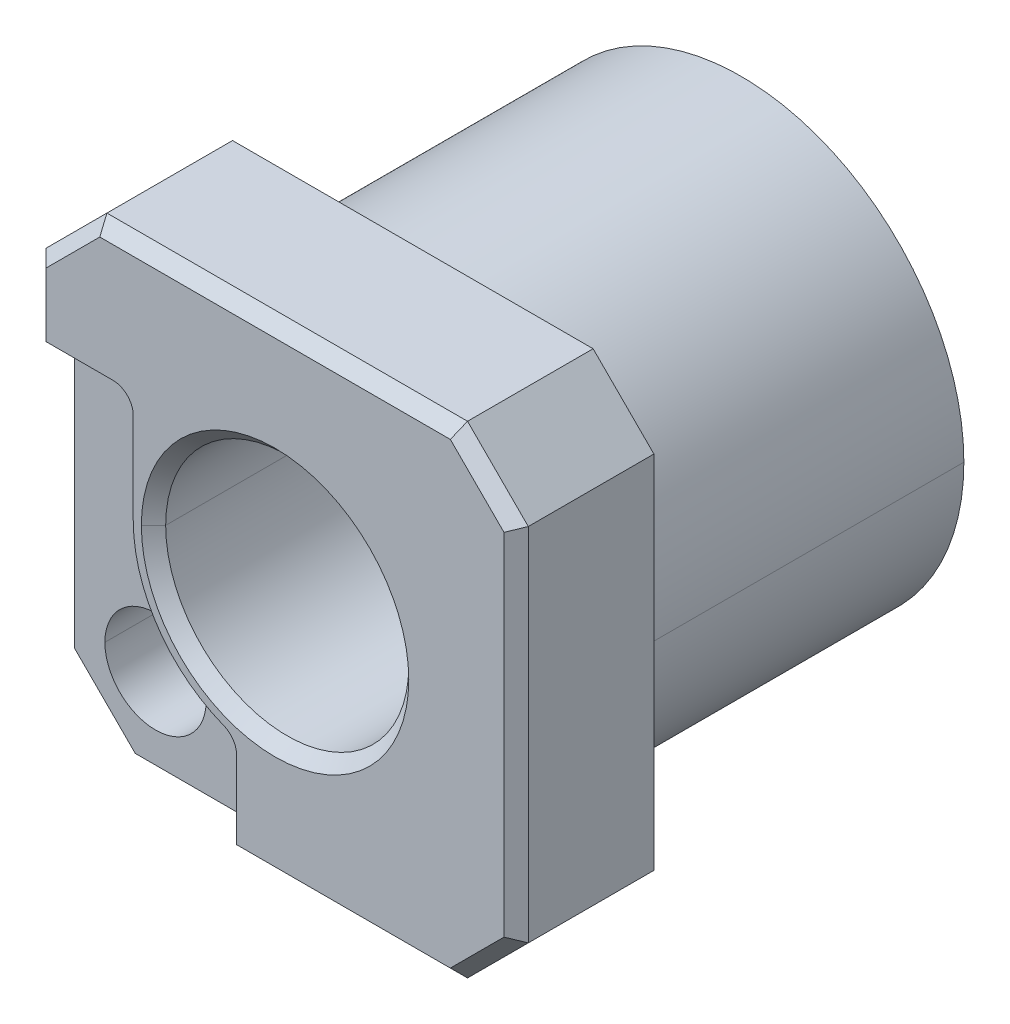
ISO-10303-21;
HEADER;
FILE_DESCRIPTION(('STEP AP214'),'2;1');
FILE_NAME('part.step','',(''),(''),'','','');
FILE_SCHEMA(('AUTOMOTIVE_DESIGN { 1 0 10303 214 1 1 1 1 }'));
ENDSEC;
DATA;
#1=APPLICATION_CONTEXT('core data for automotive mechanical design processes');
#2=APPLICATION_PROTOCOL_DEFINITION('international standard','automotive_design',2000,#1);
#3=PRODUCT_CONTEXT('',#1,'mechanical');
#4=PRODUCT('Part','Part','',(#3));
#5=PRODUCT_RELATED_PRODUCT_CATEGORY('part','',(#4));
#6=PRODUCT_DEFINITION_FORMATION('','',#4);
#7=PRODUCT_DEFINITION_CONTEXT('part definition',#1,'design');
#8=PRODUCT_DEFINITION('design','',#6,#7);
#9=PRODUCT_DEFINITION_SHAPE('','',#8);
#10=(LENGTH_UNIT() NAMED_UNIT(*) SI_UNIT(.MILLI.,.METRE.));
#11=(NAMED_UNIT(*) PLANE_ANGLE_UNIT() SI_UNIT($,.RADIAN.));
#12=(NAMED_UNIT(*) SI_UNIT($,.STERADIAN.) SOLID_ANGLE_UNIT());
#13=UNCERTAINTY_MEASURE_WITH_UNIT(LENGTH_MEASURE(1.E-05),#10,'distance_accuracy_value','');
#14=(GEOMETRIC_REPRESENTATION_CONTEXT(3) GLOBAL_UNCERTAINTY_ASSIGNED_CONTEXT((#13)) GLOBAL_UNIT_ASSIGNED_CONTEXT((#10,
#11,#12)) REPRESENTATION_CONTEXT('',''));
#15=CARTESIAN_POINT('',(0.,0.,0.));
#16=DIRECTION('',(0.,0.,1.));
#17=DIRECTION('',(1.,0.,0.));
#18=AXIS2_PLACEMENT_3D('',#15,#16,#17);
#19=CARTESIAN_POINT('',(0.,0.,0.));
#20=DIRECTION('',(0.,0.,1.));
#21=DIRECTION('',(1.,0.,0.));
#22=AXIS2_PLACEMENT_3D('',#19,#20,#21);
#23=CYLINDRICAL_SURFACE('',#22,5.5);
#24=DIRECTION('',(0.,0.,1.));
#25=VECTOR('',#24,1.);
#26=CARTESIAN_POINT('',(-5.5,0.,0.));
#27=LINE('',#26,#25);
#28=CARTESIAN_POINT('',(-5.5,0.,-8.1));
#29=VERTEX_POINT('',#28);
#30=CARTESIAN_POINT('',(-5.5,0.,0.));
#31=VERTEX_POINT('',#30);
#32=EDGE_CURVE('E361',#29,#31,#27,.T.);
#33=ORIENTED_EDGE('',*,*,#32,.F.);
#34=CARTESIAN_POINT('',(0.,0.,-8.1));
#35=DIRECTION('',(0.,0.,1.));
#36=DIRECTION('',(1.,0.,0.));
#37=AXIS2_PLACEMENT_3D('',#34,#35,#36);
#38=CIRCLE('',#37,5.5);
#39=CARTESIAN_POINT('',(5.5,0.,-8.1));
#40=VERTEX_POINT('',#39);
#41=EDGE_CURVE('E285',#29,#40,#38,.T.);
#42=ORIENTED_EDGE('',*,*,#41,.T.);
#43=DIRECTION('',(0.,0.,1.));
#44=VECTOR('',#43,1.);
#45=CARTESIAN_POINT('',(5.5,0.,0.));
#46=LINE('',#45,#44);
#47=CARTESIAN_POINT('',(5.5,0.,0.));
#48=VERTEX_POINT('',#47);
#49=EDGE_CURVE('E360',#40,#48,#46,.T.);
#50=ORIENTED_EDGE('',*,*,#49,.T.);
#51=CARTESIAN_POINT('',(0.,0.,0.));
#52=DIRECTION('',(0.,0.,-1.));
#53=DIRECTION('',(1.,0.,0.));
#54=AXIS2_PLACEMENT_3D('',#51,#52,#53);
#55=CIRCLE('',#54,5.5);
#56=CARTESIAN_POINT('',(-2.921261188788,-4.660067925136,0.));
#57=VERTEX_POINT('',#56);
#58=EDGE_CURVE('E403',#48,#57,#55,.T.);
#59=ORIENTED_EDGE('',*,*,#58,.T.);
#60=CARTESIAN_POINT('',(0.,0.,0.));
#61=DIRECTION('',(0.,0.,-1.));
#62=DIRECTION('',(1.,0.,0.));
#63=AXIS2_PLACEMENT_3D('',#60,#61,#62);
#64=CIRCLE('',#63,5.5);
#65=CARTESIAN_POINT('',(-4.660067925136,-2.921261188788,0.));
#66=VERTEX_POINT('',#65);
#67=EDGE_CURVE('E28',#57,#66,#64,.T.);
#68=ORIENTED_EDGE('',*,*,#67,.T.);
#69=CARTESIAN_POINT('',(0.,0.,0.));
#70=DIRECTION('',(0.,0.,-1.));
#71=DIRECTION('',(1.,0.,0.));
#72=AXIS2_PLACEMENT_3D('',#69,#70,#71);
#73=CIRCLE('',#72,5.5);
#74=EDGE_CURVE('E378',#66,#31,#73,.T.);
#75=ORIENTED_EDGE('',*,*,#74,.T.);
#76=EDGE_LOOP('',(#33,#42,#50,#59,#68,#75));
#77=FACE_BOUND('',#76,.T.);
#78=ADVANCED_FACE('F17',(#77),#23,.T.);
#79=CARTESIAN_POINT('',(-3.95,-3.95,2.4));
#80=DIRECTION('',(0.,0.,1.));
#81=DIRECTION('',(1.,0.,0.));
#82=AXIS2_PLACEMENT_3D('',#79,#80,#81);
#83=CYLINDRICAL_SURFACE('',#82,1.25);
#84=DIRECTION('',(0.,0.,1.));
#85=VECTOR('',#84,1.);
#86=CARTESIAN_POINT('',(-5.2,-3.95,2.4));
#87=LINE('',#86,#85);
#88=CARTESIAN_POINT('',(-5.2,-3.95,0.));
#89=VERTEX_POINT('',#88);
#90=CARTESIAN_POINT('',(-5.2,-3.95,2.4));
#91=VERTEX_POINT('',#90);
#92=EDGE_CURVE('E435',#89,#91,#87,.T.);
#93=ORIENTED_EDGE('',*,*,#92,.F.);
#94=CARTESIAN_POINT('',(-3.95,-3.95,0.));
#95=DIRECTION('',(0.,0.,1.));
#96=DIRECTION('',(1.,0.,0.));
#97=AXIS2_PLACEMENT_3D('',#94,#95,#96);
#98=CIRCLE('',#97,1.25);
#99=EDGE_CURVE('E381',#66,#89,#98,.T.);
#100=ORIENTED_EDGE('',*,*,#99,.F.);
#101=CARTESIAN_POINT('',(-3.95,-3.95,0.));
#102=DIRECTION('',(0.,0.,1.));
#103=DIRECTION('',(1.,0.,0.));
#104=AXIS2_PLACEMENT_3D('',#101,#102,#103);
#105=CIRCLE('',#104,1.25);
#106=CARTESIAN_POINT('',(-2.7,-3.95,0.));
#107=VERTEX_POINT('',#106);
#108=EDGE_CURVE('E284',#107,#66,#105,.T.);
#109=ORIENTED_EDGE('',*,*,#108,.F.);
#110=DIRECTION('',(0.,0.,1.));
#111=VECTOR('',#110,1.);
#112=CARTESIAN_POINT('',(-2.7,-3.95,2.4));
#113=LINE('',#112,#111);
#114=CARTESIAN_POINT('',(-2.7,-3.95,2.4));
#115=VERTEX_POINT('',#114);
#116=EDGE_CURVE('E412',#107,#115,#113,.T.);
#117=ORIENTED_EDGE('',*,*,#116,.T.);
#118=CARTESIAN_POINT('',(-3.95,-3.95,2.4));
#119=DIRECTION('',(0.,0.,1.));
#120=DIRECTION('',(1.,0.,0.));
#121=AXIS2_PLACEMENT_3D('',#118,#119,#120);
#122=CIRCLE('',#121,1.25);
#123=EDGE_CURVE('E400',#115,#91,#122,.T.);
#124=ORIENTED_EDGE('',*,*,#123,.T.);
#125=EDGE_LOOP('',(#93,#100,#109,#117,#124));
#126=FACE_BOUND('',#125,.T.);
#127=ADVANCED_FACE('F683',(#126),#83,.F.);
#128=CARTESIAN_POINT('',(0.,0.,3.1));
#129=DIRECTION('',(0.,0.,1.));
#130=DIRECTION('',(1.,0.,0.));
#131=AXIS2_PLACEMENT_3D('',#128,#129,#130);
#132=CONICAL_SURFACE('',#131,3.,0.785398163397001);
#133=DIRECTION('',(-0.707106781186231,0.,0.707106781186864));
#134=VECTOR('',#133,1.);
#135=CARTESIAN_POINT('',(-3.,0.,3.1));
#136=LINE('',#135,#134);
#137=CARTESIAN_POINT('',(-3.,0.,3.1));
#138=VERTEX_POINT('',#137);
#139=CARTESIAN_POINT('',(-3.29999999999973,0.,3.4));
#140=VERTEX_POINT('',#139);
#141=EDGE_CURVE('E390',#138,#140,#136,.T.);
#142=ORIENTED_EDGE('',*,*,#141,.F.);
#143=CARTESIAN_POINT('',(0.,0.,3.1));
#144=DIRECTION('',(0.,0.,1.));
#145=DIRECTION('',(1.,0.,0.));
#146=AXIS2_PLACEMENT_3D('',#143,#144,#145);
#147=CIRCLE('',#146,3.);
#148=CARTESIAN_POINT('',(3.,0.,3.1));
#149=VERTEX_POINT('',#148);
#150=EDGE_CURVE('E11',#149,#138,#147,.T.);
#151=ORIENTED_EDGE('',*,*,#150,.F.);
#152=DIRECTION('',(0.707106781186231,0.,0.707106781186864));
#153=VECTOR('',#152,1.);
#154=CARTESIAN_POINT('',(3.,0.,3.1));
#155=LINE('',#154,#153);
#156=CARTESIAN_POINT('',(3.29999999999973,0.,3.4));
#157=VERTEX_POINT('',#156);
#158=EDGE_CURVE('E297',#149,#157,#155,.T.);
#159=ORIENTED_EDGE('',*,*,#158,.T.);
#160=CARTESIAN_POINT('',(0.,0.,3.4));
#161=DIRECTION('',(0.,0.,1.));
#162=DIRECTION('',(1.,0.,0.));
#163=AXIS2_PLACEMENT_3D('',#160,#161,#162);
#164=CIRCLE('',#163,3.3);
#165=EDGE_CURVE('E258',#157,#140,#164,.T.);
#166=ORIENTED_EDGE('',*,*,#165,.T.);
#167=EDGE_LOOP('',(#142,#151,#159,#166));
#168=FACE_BOUND('',#167,.T.);
#169=ADVANCED_FACE('F681',(#168),#132,.F.);
#170=CARTESIAN_POINT('',(0.,0.,0.));
#171=DIRECTION('',(0.,0.,1.));
#172=DIRECTION('',(1.,0.,0.));
#173=AXIS2_PLACEMENT_3D('',#170,#171,#172);
#174=CYLINDRICAL_SURFACE('',#173,3.);
#175=DIRECTION('',(0.,0.,1.));
#176=VECTOR('',#175,1.);
#177=CARTESIAN_POINT('',(-3.,0.,0.));
#178=LINE('',#177,#176);
#179=CARTESIAN_POINT('',(-3.,0.,-8.1));
#180=VERTEX_POINT('',#179);
#181=EDGE_CURVE('E288',#180,#138,#178,.T.);
#182=ORIENTED_EDGE('',*,*,#181,.F.);
#183=CARTESIAN_POINT('',(0.,0.,-8.1));
#184=DIRECTION('',(0.,0.,1.));
#185=DIRECTION('',(1.,0.,0.));
#186=AXIS2_PLACEMENT_3D('',#183,#184,#185);
#187=CIRCLE('',#186,3.);
#188=CARTESIAN_POINT('',(3.,0.,-8.1));
#189=VERTEX_POINT('',#188);
#190=EDGE_CURVE('E275',#189,#180,#187,.T.);
#191=ORIENTED_EDGE('',*,*,#190,.F.);
#192=DIRECTION('',(0.,0.,1.));
#193=VECTOR('',#192,1.);
#194=CARTESIAN_POINT('',(3.,0.,0.));
#195=LINE('',#194,#193);
#196=EDGE_CURVE('E293',#189,#149,#195,.T.);
#197=ORIENTED_EDGE('',*,*,#196,.T.);
#198=ORIENTED_EDGE('',*,*,#150,.T.);
#199=EDGE_LOOP('',(#182,#191,#197,#198));
#200=FACE_BOUND('',#199,.T.);
#201=ADVANCED_FACE('F289',(#200),#174,.F.);
#202=CARTESIAN_POINT('',(0.,0.,0.));
#203=DIRECTION('',(0.,0.,1.));
#204=DIRECTION('',(1.,0.,0.));
#205=AXIS2_PLACEMENT_3D('',#202,#203,#204);
#206=PLANE('',#205);
#207=CARTESIAN_POINT('',(-3.95,-3.95,0.));
#208=DIRECTION('',(0.,0.,1.));
#209=DIRECTION('',(1.,0.,0.));
#210=AXIS2_PLACEMENT_3D('',#207,#208,#209);
#211=CIRCLE('',#210,1.25);
#212=EDGE_CURVE('E391',#57,#107,#211,.T.);
#213=ORIENTED_EDGE('',*,*,#212,.T.);
#214=ORIENTED_EDGE('',*,*,#108,.T.);
#215=ORIENTED_EDGE('',*,*,#67,.F.);
#216=EDGE_LOOP('',(#213,#214,#215));
#217=FACE_BOUND('',#216,.T.);
#218=ADVANCED_FACE('F690',(#217),#206,.T.);
#219=CARTESIAN_POINT('',(0.,0.,-8.1));
#220=DIRECTION('',(0.,0.,1.));
#221=DIRECTION('',(1.,0.,0.));
#222=AXIS2_PLACEMENT_3D('',#219,#220,#221);
#223=PLANE('',#222);
#224=ORIENTED_EDGE('',*,*,#190,.T.);
#225=CARTESIAN_POINT('',(0.,0.,-8.1));
#226=DIRECTION('',(0.,0.,1.));
#227=DIRECTION('',(1.,0.,0.));
#228=AXIS2_PLACEMENT_3D('',#225,#226,#227);
#229=CIRCLE('',#228,3.);
#230=EDGE_CURVE('E280',#180,#189,#229,.T.);
#231=ORIENTED_EDGE('',*,*,#230,.T.);
#232=EDGE_LOOP('',(#224,#231));
#233=FACE_BOUND('',#232,.T.);
#234=CARTESIAN_POINT('',(0.,0.,-8.1));
#235=DIRECTION('',(0.,0.,1.));
#236=DIRECTION('',(1.,0.,0.));
#237=AXIS2_PLACEMENT_3D('',#234,#235,#236);
#238=CIRCLE('',#237,5.5);
#239=EDGE_CURVE('E554',#40,#29,#238,.T.);
#240=ORIENTED_EDGE('',*,*,#239,.F.);
#241=ORIENTED_EDGE('',*,*,#41,.F.);
#242=EDGE_LOOP('',(#240,#241));
#243=FACE_BOUND('',#242,.T.);
#244=ADVANCED_FACE('F277',(#233,#243),#223,.F.);
#245=CARTESIAN_POINT('',(4.45,-5.8,3.25));
#246=DIRECTION('',(0.,-0.707106781186548,0.707106781186548));
#247=DIRECTION('',(-1.,0.,0.));
#248=AXIS2_PLACEMENT_3D('',#245,#246,#247);
#249=PLANE('',#248);
#250=DIRECTION('',(0.281084637714927,-0.678598344545825,-0.678598344545825));
#251=VECTOR('',#250,1.);
#252=CARTESIAN_POINT('',(4.308975681847,-5.609537178492,3.440462821508));
#253=LINE('',#252,#251);
#254=CARTESIAN_POINT('',(4.325735931288,-5.65,3.4));
#255=VERTEX_POINT('',#254);
#256=CARTESIAN_POINT('',(4.45,-5.95,3.1));
#257=VERTEX_POINT('',#256);
#258=EDGE_CURVE('E451',#255,#257,#253,.T.);
#259=ORIENTED_EDGE('',*,*,#258,.F.);
#260=DIRECTION('',(-1.,0.,0.));
#261=VECTOR('',#260,1.);
#262=CARTESIAN_POINT('',(4.45,-5.65,3.4));
#263=LINE('',#262,#261);
#264=CARTESIAN_POINT('',(-0.95,-5.65,3.4));
#265=VERTEX_POINT('',#264);
#266=EDGE_CURVE('E320',#255,#265,#263,.T.);
#267=ORIENTED_EDGE('',*,*,#266,.T.);
#268=DIRECTION('',(0.,-0.707106781186548,-0.707106781186548));
#269=VECTOR('',#268,1.);
#270=CARTESIAN_POINT('',(-0.95,-5.244483771318,3.805516228682));
#271=LINE('',#270,#269);
#272=CARTESIAN_POINT('',(-0.95,-5.95,3.1));
#273=VERTEX_POINT('',#272);
#274=EDGE_CURVE('E328',#265,#273,#271,.T.);
#275=ORIENTED_EDGE('',*,*,#274,.T.);
#276=DIRECTION('',(-1.,0.,0.));
#277=VECTOR('',#276,1.);
#278=CARTESIAN_POINT('',(4.45,-5.95,3.1));
#279=LINE('',#278,#277);
#280=EDGE_CURVE('E459',#257,#273,#279,.T.);
#281=ORIENTED_EDGE('',*,*,#280,.F.);
#282=EDGE_LOOP('',(#259,#267,#275,#281));
#283=FACE_BOUND('',#282,.T.);
#284=ADVANCED_FACE('F608',(#283),#249,.T.);
#285=CARTESIAN_POINT('',(5.843933982822,-4.343933982822,3.25));
#286=DIRECTION('',(0.49999999999984,-0.49999999999984,0.707106781186774));
#287=DIRECTION('',(-0.707106781186548,-0.707106781186548,0.));
#288=AXIS2_PLACEMENT_3D('',#285,#286,#287);
#289=PLANE('',#288);
#290=DIRECTION('',(0.678598344545825,-0.281084637714927,-0.678598344545825));
#291=VECTOR('',#290,1.);
#292=CARTESIAN_POINT('',(4.963042400288,-4.041188776712,4.086957599712));
#293=LINE('',#292,#291);
#294=CARTESIAN_POINT('',(5.65,-4.325735931288,3.4));
#295=VERTEX_POINT('',#294);
#296=CARTESIAN_POINT('',(5.95,-4.45,3.1));
#297=VERTEX_POINT('',#296);
#298=EDGE_CURVE('E239',#295,#297,#293,.T.);
#299=ORIENTED_EDGE('',*,*,#298,.F.);
#300=DIRECTION('',(-0.707106781186548,-0.707106781186548,0.));
#301=VECTOR('',#300,1.);
#302=CARTESIAN_POINT('',(5.737867965644,-4.237867965644,3.4));
#303=LINE('',#302,#301);
#304=EDGE_CURVE('E324',#295,#255,#303,.T.);
#305=ORIENTED_EDGE('',*,*,#304,.T.);
#306=ORIENTED_EDGE('',*,*,#258,.T.);
#307=DIRECTION('',(-0.707106781186548,-0.707106781186548,0.));
#308=VECTOR('',#307,1.);
#309=CARTESIAN_POINT('',(5.95,-4.45,3.1));
#310=LINE('',#309,#308);
#311=EDGE_CURVE('E411',#297,#257,#310,.T.);
#312=ORIENTED_EDGE('',*,*,#311,.F.);
#313=EDGE_LOOP('',(#299,#305,#306,#312));
#314=FACE_BOUND('',#313,.T.);
#315=ADVANCED_FACE('F604',(#314),#289,.T.);
#316=CARTESIAN_POINT('',(-0.95,-3.727935085272,3.4));
#317=DIRECTION('',(-1.,0.,0.));
#318=DIRECTION('',(0.,0.,1.));
#319=AXIS2_PLACEMENT_3D('',#316,#317,#318);
#320=PLANE('',#319);
#321=DIRECTION('',(0.,0.,-1.));
#322=VECTOR('',#321,1.);
#323=CARTESIAN_POINT('',(-0.95,-5.95,3.4));
#324=LINE('',#323,#322);
#325=CARTESIAN_POINT('',(-0.95,-5.95,2.4));
#326=VERTEX_POINT('',#325);
#327=EDGE_CURVE('E463',#273,#326,#324,.T.);
#328=ORIENTED_EDGE('',*,*,#327,.F.);
#329=ORIENTED_EDGE('',*,*,#274,.F.);
#330=DIRECTION('',(0.,-1.,0.));
#331=VECTOR('',#330,1.);
#332=CARTESIAN_POINT('',(-0.95,-3.727935085272,3.4));
#333=LINE('',#332,#331);
#334=CARTESIAN_POINT('',(-0.95,-3.727935085272,3.4));
#335=VERTEX_POINT('',#334);
#336=EDGE_CURVE('E325',#335,#265,#333,.T.);
#337=ORIENTED_EDGE('',*,*,#336,.F.);
#338=DIRECTION('',(0.,0.,-1.));
#339=VECTOR('',#338,1.);
#340=CARTESIAN_POINT('',(-0.95,-3.727935085272,3.4));
#341=LINE('',#340,#339);
#342=CARTESIAN_POINT('',(-0.95,-3.727935085272,2.4));
#343=VERTEX_POINT('',#342);
#344=EDGE_CURVE('E329',#335,#343,#341,.T.);
#345=ORIENTED_EDGE('',*,*,#344,.T.);
#346=DIRECTION('',(0.,-1.,0.));
#347=VECTOR('',#346,1.);
#348=CARTESIAN_POINT('',(-0.95,-3.727935085272,2.4));
#349=LINE('',#348,#347);
#350=EDGE_CURVE('E386',#343,#326,#349,.T.);
#351=ORIENTED_EDGE('',*,*,#350,.T.);
#352=EDGE_LOOP('',(#328,#329,#337,#345,#351));
#353=FACE_BOUND('',#352,.T.);
#354=ADVANCED_FACE('F614',(#353),#320,.T.);
#355=CARTESIAN_POINT('',(5.8,4.45,3.25));
#356=DIRECTION('',(0.707106781186548,0.,0.707106781186548));
#357=DIRECTION('',(0.,-1.,0.));
#358=AXIS2_PLACEMENT_3D('',#355,#356,#357);
#359=PLANE('',#358);
#360=DIRECTION('',(-0.678598344545825,-0.281084637714927,0.678598344545825));
#361=VECTOR('',#360,1.);
#362=CARTESIAN_POINT('',(5.609537178492,4.308975681847,3.440462821508));
#363=LINE('',#362,#361);
#364=CARTESIAN_POINT('',(5.95,4.45,3.1));
#365=VERTEX_POINT('',#364);
#366=CARTESIAN_POINT('',(5.65,4.325735931288,3.4));
#367=VERTEX_POINT('',#366);
#368=EDGE_CURVE('E247',#365,#367,#363,.T.);
#369=ORIENTED_EDGE('',*,*,#368,.T.);
#370=DIRECTION('',(0.,-1.,0.));
#371=VECTOR('',#370,1.);
#372=CARTESIAN_POINT('',(5.65,4.45,3.4));
#373=LINE('',#372,#371);
#374=EDGE_CURVE('E495',#367,#295,#373,.T.);
#375=ORIENTED_EDGE('',*,*,#374,.T.);
#376=ORIENTED_EDGE('',*,*,#298,.T.);
#377=DIRECTION('',(0.,-1.,0.));
#378=VECTOR('',#377,1.);
#379=CARTESIAN_POINT('',(5.95,4.45,3.1));
#380=LINE('',#379,#378);
#381=EDGE_CURVE('E367',#365,#297,#380,.T.);
#382=ORIENTED_EDGE('',*,*,#381,.F.);
#383=EDGE_LOOP('',(#369,#375,#376,#382));
#384=FACE_BOUND('',#383,.T.);
#385=ADVANCED_FACE('F744',(#384),#359,.T.);
#386=CARTESIAN_POINT('',(-1.45,-3.727935085272,3.4));
#387=DIRECTION('',(0.,0.,1.));
#388=DIRECTION('',(1.,0.,0.));
#389=AXIS2_PLACEMENT_3D('',#386,#387,#388);
#390=CYLINDRICAL_SURFACE('',#389,0.5);
#391=CARTESIAN_POINT('',(-1.45,-3.727935085272,3.4));
#392=DIRECTION('',(0.,0.,1.));
#393=DIRECTION('',(1.,0.,0.));
#394=AXIS2_PLACEMENT_3D('',#391,#392,#393);
#395=CIRCLE('',#394,0.5);
#396=CARTESIAN_POINT('',(-1.26875,-3.261943199613,3.4));
#397=VERTEX_POINT('',#396);
#398=EDGE_CURVE('E319',#335,#397,#395,.T.);
#399=ORIENTED_EDGE('',*,*,#398,.T.);
#400=DIRECTION('',(0.,0.,-1.));
#401=VECTOR('',#400,1.);
#402=CARTESIAN_POINT('',(-1.26875,-3.261943199613,3.4));
#403=LINE('',#402,#401);
#404=CARTESIAN_POINT('',(-1.26875,-3.261943199613,2.4));
#405=VERTEX_POINT('',#404);
#406=EDGE_CURVE('E450',#397,#405,#403,.T.);
#407=ORIENTED_EDGE('',*,*,#406,.T.);
#408=CARTESIAN_POINT('',(-1.45,-3.727935085272,2.4));
#409=DIRECTION('',(0.,0.,1.));
#410=DIRECTION('',(1.,0.,0.));
#411=AXIS2_PLACEMENT_3D('',#408,#409,#410);
#412=CIRCLE('',#411,0.5);
#413=EDGE_CURVE('E373',#343,#405,#412,.T.);
#414=ORIENTED_EDGE('',*,*,#413,.F.);
#415=ORIENTED_EDGE('',*,*,#344,.F.);
#416=EDGE_LOOP('',(#399,#407,#414,#415));
#417=FACE_BOUND('',#416,.T.);
#418=ADVANCED_FACE('F732',(#417),#390,.F.);
#419=CARTESIAN_POINT('',(0.,0.,3.4));
#420=DIRECTION('',(0.,0.,1.));
#421=DIRECTION('',(1.,0.,0.));
#422=AXIS2_PLACEMENT_3D('',#419,#420,#421);
#423=CYLINDRICAL_SURFACE('',#422,3.5);
#424=DIRECTION('',(0.,0.,-1.));
#425=VECTOR('',#424,1.);
#426=CARTESIAN_POINT('',(-3.5,0.,3.4));
#427=LINE('',#426,#425);
#428=CARTESIAN_POINT('',(-3.5,0.,3.4));
#429=VERTEX_POINT('',#428);
#430=CARTESIAN_POINT('',(-3.5,0.,2.4));
#431=VERTEX_POINT('',#430);
#432=EDGE_CURVE('E399',#429,#431,#427,.T.);
#433=ORIENTED_EDGE('',*,*,#432,.T.);
#434=CARTESIAN_POINT('',(0.,0.,2.4));
#435=DIRECTION('',(0.,0.,1.));
#436=DIRECTION('',(1.,0.,0.));
#437=AXIS2_PLACEMENT_3D('',#434,#435,#436);
#438=CIRCLE('',#437,3.5);
#439=EDGE_CURVE('E368',#431,#405,#438,.T.);
#440=ORIENTED_EDGE('',*,*,#439,.T.);
#441=ORIENTED_EDGE('',*,*,#406,.F.);
#442=CARTESIAN_POINT('',(0.,0.,3.4));
#443=DIRECTION('',(0.,0.,1.));
#444=DIRECTION('',(1.,0.,0.));
#445=AXIS2_PLACEMENT_3D('',#442,#443,#444);
#446=CIRCLE('',#445,3.5);
#447=EDGE_CURVE('E315',#429,#397,#446,.T.);
#448=ORIENTED_EDGE('',*,*,#447,.F.);
#449=EDGE_LOOP('',(#433,#440,#441,#448));
#450=FACE_BOUND('',#449,.T.);
#451=ADVANCED_FACE('F729',(#450),#423,.T.);
#452=CARTESIAN_POINT('',(-3.5,2.25,3.4));
#453=DIRECTION('',(-1.,0.,0.));
#454=DIRECTION('',(0.,0.,1.));
#455=AXIS2_PLACEMENT_3D('',#452,#453,#454);
#456=PLANE('',#455);
#457=DIRECTION('',(0.,0.,-1.));
#458=VECTOR('',#457,1.);
#459=CARTESIAN_POINT('',(-3.5,2.25,3.4));
#460=LINE('',#459,#458);
#461=CARTESIAN_POINT('',(-3.5,2.25,3.4));
#462=VERTEX_POINT('',#461);
#463=CARTESIAN_POINT('',(-3.5,2.25,2.4));
#464=VERTEX_POINT('',#463);
#465=EDGE_CURVE('E43',#462,#464,#460,.T.);
#466=ORIENTED_EDGE('',*,*,#465,.T.);
#467=DIRECTION('',(0.,-1.,0.));
#468=VECTOR('',#467,1.);
#469=CARTESIAN_POINT('',(-3.5,2.25,2.4));
#470=LINE('',#469,#468);
#471=EDGE_CURVE('E372',#464,#431,#470,.T.);
#472=ORIENTED_EDGE('',*,*,#471,.T.);
#473=ORIENTED_EDGE('',*,*,#432,.F.);
#474=DIRECTION('',(0.,-1.,0.));
#475=VECTOR('',#474,1.);
#476=CARTESIAN_POINT('',(-3.5,2.25,3.4));
#477=LINE('',#476,#475);
#478=EDGE_CURVE('E21',#462,#429,#477,.T.);
#479=ORIENTED_EDGE('',*,*,#478,.F.);
#480=EDGE_LOOP('',(#466,#472,#473,#479));
#481=FACE_BOUND('',#480,.T.);
#482=ADVANCED_FACE('F19',(#481),#456,.T.);
#483=CARTESIAN_POINT('',(-4.,2.25,3.4));
#484=DIRECTION('',(0.,0.,1.));
#485=DIRECTION('',(1.,0.,0.));
#486=AXIS2_PLACEMENT_3D('',#483,#484,#485);
#487=CYLINDRICAL_SURFACE('',#486,0.5);
#488=CARTESIAN_POINT('',(-4.,2.25,3.4));
#489=DIRECTION('',(0.,0.,1.));
#490=DIRECTION('',(1.,0.,0.));
#491=AXIS2_PLACEMENT_3D('',#488,#489,#490);
#492=CIRCLE('',#491,0.5);
#493=CARTESIAN_POINT('',(-4.,2.75,3.4));
#494=VERTEX_POINT('',#493);
#495=EDGE_CURVE('E347',#462,#494,#492,.T.);
#496=ORIENTED_EDGE('',*,*,#495,.T.);
#497=DIRECTION('',(0.,0.,-1.));
#498=VECTOR('',#497,1.);
#499=CARTESIAN_POINT('',(-4.,2.75,3.4));
#500=LINE('',#499,#498);
#501=CARTESIAN_POINT('',(-4.,2.75,2.4));
#502=VERTEX_POINT('',#501);
#503=EDGE_CURVE('E392',#494,#502,#500,.T.);
#504=ORIENTED_EDGE('',*,*,#503,.T.);
#505=CARTESIAN_POINT('',(-4.,2.25,2.4));
#506=DIRECTION('',(0.,0.,1.));
#507=DIRECTION('',(1.,0.,0.));
#508=AXIS2_PLACEMENT_3D('',#505,#506,#507);
#509=CIRCLE('',#508,0.5);
#510=EDGE_CURVE('E404',#464,#502,#509,.T.);
#511=ORIENTED_EDGE('',*,*,#510,.F.);
#512=ORIENTED_EDGE('',*,*,#465,.F.);
#513=EDGE_LOOP('',(#496,#504,#511,#512));
#514=FACE_BOUND('',#513,.T.);
#515=ADVANCED_FACE('F577',(#514),#487,.F.);
#516=CARTESIAN_POINT('',(-4.028350418133,-2.114058066306,2.4));
#517=DIRECTION('',(0.,0.,1.));
#518=DIRECTION('',(1.,0.,0.));
#519=AXIS2_PLACEMENT_3D('',#516,#517,#518);
#520=PLANE('',#519);
#521=ORIENTED_EDGE('',*,*,#123,.F.);
#522=CARTESIAN_POINT('',(-3.95,-3.95,2.4));
#523=DIRECTION('',(0.,0.,1.));
#524=DIRECTION('',(1.,0.,0.));
#525=AXIS2_PLACEMENT_3D('',#522,#523,#524);
#526=CIRCLE('',#525,1.25);
#527=EDGE_CURVE('E416',#91,#115,#526,.T.);
#528=ORIENTED_EDGE('',*,*,#527,.F.);
#529=EDGE_LOOP('',(#521,#528));
#530=FACE_BOUND('',#529,.T.);
#531=DIRECTION('',(-1.,0.,0.));
#532=VECTOR('',#531,1.);
#533=CARTESIAN_POINT('',(-0.95,-5.95,2.4));
#534=LINE('',#533,#532);
#535=CARTESIAN_POINT('',(-4.45,-5.95,2.4));
#536=VERTEX_POINT('',#535);
#537=EDGE_CURVE('E420',#326,#536,#534,.T.);
#538=ORIENTED_EDGE('',*,*,#537,.F.);
#539=ORIENTED_EDGE('',*,*,#350,.F.);
#540=ORIENTED_EDGE('',*,*,#413,.T.);
#541=ORIENTED_EDGE('',*,*,#439,.F.);
#542=ORIENTED_EDGE('',*,*,#471,.F.);
#543=ORIENTED_EDGE('',*,*,#510,.T.);
#544=DIRECTION('',(1.,0.,0.));
#545=VECTOR('',#544,1.);
#546=CARTESIAN_POINT('',(-5.95,2.75,2.4));
#547=LINE('',#546,#545);
#548=CARTESIAN_POINT('',(-5.95,2.75,2.4));
#549=VERTEX_POINT('',#548);
#550=EDGE_CURVE('E396',#549,#502,#547,.T.);
#551=ORIENTED_EDGE('',*,*,#550,.F.);
#552=DIRECTION('',(0.,1.,0.));
#553=VECTOR('',#552,1.);
#554=CARTESIAN_POINT('',(-5.95,-5.95,2.4));
#555=LINE('',#554,#553);
#556=CARTESIAN_POINT('',(-5.95,-4.45,2.4));
#557=VERTEX_POINT('',#556);
#558=EDGE_CURVE('E334',#557,#549,#555,.T.);
#559=ORIENTED_EDGE('',*,*,#558,.F.);
#560=DIRECTION('',(0.707106781186548,-0.707106781186548,0.));
#561=VECTOR('',#560,1.);
#562=CARTESIAN_POINT('',(-5.678573087957,-4.721426912043,2.4));
#563=LINE('',#562,#561);
#564=EDGE_CURVE('E377',#557,#536,#563,.T.);
#565=ORIENTED_EDGE('',*,*,#564,.T.);
#566=EDGE_LOOP('',(#538,#539,#540,#541,#542,#543,#551,#559,#565));
#567=FACE_BOUND('',#566,.T.);
#568=ADVANCED_FACE('F573',(#530,#567),#520,.T.);
#569=CARTESIAN_POINT('',(-5.95,2.75,3.4));
#570=DIRECTION('',(0.,-1.,0.));
#571=DIRECTION('',(0.,0.,-1.));
#572=AXIS2_PLACEMENT_3D('',#569,#570,#571);
#573=PLANE('',#572);
#574=DIRECTION('',(0.,0.,-1.));
#575=VECTOR('',#574,1.);
#576=CARTESIAN_POINT('',(-5.95,2.75,3.4));
#577=LINE('',#576,#575);
#578=CARTESIAN_POINT('',(-5.95,2.75,3.1));
#579=VERTEX_POINT('',#578);
#580=EDGE_CURVE('E427',#579,#549,#577,.T.);
#581=ORIENTED_EDGE('',*,*,#580,.T.);
#582=ORIENTED_EDGE('',*,*,#550,.T.);
#583=ORIENTED_EDGE('',*,*,#503,.F.);
#584=DIRECTION('',(1.,0.,0.));
#585=VECTOR('',#584,1.);
#586=CARTESIAN_POINT('',(-5.95,2.75,3.4));
#587=LINE('',#586,#585);
#588=CARTESIAN_POINT('',(-5.65,2.75,3.4));
#589=VERTEX_POINT('',#588);
#590=EDGE_CURVE('E351',#589,#494,#587,.T.);
#591=ORIENTED_EDGE('',*,*,#590,.F.);
#592=DIRECTION('',(-0.707106781186548,0.,-0.707106781186548));
#593=VECTOR('',#592,1.);
#594=CARTESIAN_POINT('',(-5.8,2.75,3.25));
#595=LINE('',#594,#593);
#596=EDGE_CURVE('E417',#589,#579,#595,.T.);
#597=ORIENTED_EDGE('',*,*,#596,.T.);
#598=EDGE_LOOP('',(#581,#582,#583,#591,#597));
#599=FACE_BOUND('',#598,.T.);
#600=ADVANCED_FACE('F567',(#599),#573,.T.);
#601=CARTESIAN_POINT('',(-5.8,2.75,3.25));
#602=DIRECTION('',(-0.707106781186548,0.,0.707106781186548));
#603=DIRECTION('',(0.,1.,0.));
#604=AXIS2_PLACEMENT_3D('',#601,#602,#603);
#605=PLANE('',#604);
#606=ORIENTED_EDGE('',*,*,#596,.F.);
#607=DIRECTION('',(0.,1.,0.));
#608=VECTOR('',#607,1.);
#609=CARTESIAN_POINT('',(-5.65,2.75,3.4));
#610=LINE('',#609,#608);
#611=CARTESIAN_POINT('',(-5.65,4.325735931288,3.4));
#612=VERTEX_POINT('',#611);
#613=EDGE_CURVE('E471',#589,#612,#610,.T.);
#614=ORIENTED_EDGE('',*,*,#613,.T.);
#615=DIRECTION('',(-0.678598344545825,0.281084637714927,-0.678598344545825));
#616=VECTOR('',#615,1.);
#617=CARTESIAN_POINT('',(-5.447405144136,4.241818394322,3.602594855864));
#618=LINE('',#617,#616);
#619=CARTESIAN_POINT('',(-5.95,4.45,3.1));
#620=VERTEX_POINT('',#619);
#621=EDGE_CURVE('E458',#612,#620,#618,.T.);
#622=ORIENTED_EDGE('',*,*,#621,.T.);
#623=DIRECTION('',(0.,1.,0.));
#624=VECTOR('',#623,1.);
#625=CARTESIAN_POINT('',(-5.95,2.75,3.1));
#626=LINE('',#625,#624);
#627=EDGE_CURVE('E423',#579,#620,#626,.T.);
#628=ORIENTED_EDGE('',*,*,#627,.F.);
#629=EDGE_LOOP('',(#606,#614,#622,#628));
#630=FACE_BOUND('',#629,.T.);
#631=ADVANCED_FACE('F751',(#630),#605,.T.);
#632=CARTESIAN_POINT('',(5.95,-5.95,0.));
#633=DIRECTION('',(0.,-1.,0.));
#634=DIRECTION('',(0.,0.,-1.));
#635=AXIS2_PLACEMENT_3D('',#632,#633,#634);
#636=PLANE('',#635);
#637=DIRECTION('',(0.,0.,1.));
#638=VECTOR('',#637,1.);
#639=CARTESIAN_POINT('',(4.45,-5.95,0.));
#640=LINE('',#639,#638);
#641=CARTESIAN_POINT('',(4.45,-5.95,0.));
#642=VERTEX_POINT('',#641);
#643=EDGE_CURVE('E464',#642,#257,#640,.T.);
#644=ORIENTED_EDGE('',*,*,#643,.T.);
#645=ORIENTED_EDGE('',*,*,#280,.T.);
#646=ORIENTED_EDGE('',*,*,#327,.T.);
#647=ORIENTED_EDGE('',*,*,#537,.T.);
#648=DIRECTION('',(0.,0.,1.));
#649=VECTOR('',#648,1.);
#650=CARTESIAN_POINT('',(-4.45,-5.95,0.));
#651=LINE('',#650,#649);
#652=CARTESIAN_POINT('',(-4.45,-5.95,0.));
#653=VERTEX_POINT('',#652);
#654=EDGE_CURVE('E366',#653,#536,#651,.T.);
#655=ORIENTED_EDGE('',*,*,#654,.F.);
#656=DIRECTION('',(-1.,0.,0.));
#657=VECTOR('',#656,1.);
#658=CARTESIAN_POINT('',(5.95,-5.95,0.));
#659=LINE('',#658,#657);
#660=EDGE_CURVE('E310',#642,#653,#659,.T.);
#661=ORIENTED_EDGE('',*,*,#660,.F.);
#662=EDGE_LOOP('',(#644,#645,#646,#647,#655,#661));
#663=FACE_BOUND('',#662,.T.);
#664=ADVANCED_FACE('F597',(#663),#636,.T.);
#665=CARTESIAN_POINT('',(5.2,-5.2,0.));
#666=DIRECTION('',(0.707106781186548,-0.707106781186548,0.));
#667=DIRECTION('',(0.,0.,-1.));
#668=AXIS2_PLACEMENT_3D('',#665,#666,#667);
#669=PLANE('',#668);
#670=DIRECTION('',(0.,0.,1.));
#671=VECTOR('',#670,1.);
#672=CARTESIAN_POINT('',(5.95,-4.45,0.));
#673=LINE('',#672,#671);
#674=CARTESIAN_POINT('',(5.95,-4.45,0.));
#675=VERTEX_POINT('',#674);
#676=EDGE_CURVE('E362',#675,#297,#673,.T.);
#677=ORIENTED_EDGE('',*,*,#676,.T.);
#678=ORIENTED_EDGE('',*,*,#311,.T.);
#679=ORIENTED_EDGE('',*,*,#643,.F.);
#680=DIRECTION('',(-0.707106781186548,-0.707106781186548,0.));
#681=VECTOR('',#680,1.);
#682=CARTESIAN_POINT('',(5.2,-5.2,0.));
#683=LINE('',#682,#681);
#684=EDGE_CURVE('E314',#675,#642,#683,.T.);
#685=ORIENTED_EDGE('',*,*,#684,.F.);
#686=EDGE_LOOP('',(#677,#678,#679,#685));
#687=FACE_BOUND('',#686,.T.);
#688=ADVANCED_FACE('F602',(#687),#669,.T.);
#689=CARTESIAN_POINT('',(-5.2,-5.2,0.));
#690=DIRECTION('',(-0.707106781186548,-0.707106781186548,0.));
#691=DIRECTION('',(-0.707106781186548,0.707106781186548,0.));
#692=AXIS2_PLACEMENT_3D('',#689,#690,#691);
#693=PLANE('',#692);
#694=ORIENTED_EDGE('',*,*,#654,.T.);
#695=ORIENTED_EDGE('',*,*,#564,.F.);
#696=DIRECTION('',(0.,0.,1.));
#697=VECTOR('',#696,1.);
#698=CARTESIAN_POINT('',(-5.95,-4.45,0.));
#699=LINE('',#698,#697);
#700=CARTESIAN_POINT('',(-5.95,-4.45,0.));
#701=VERTEX_POINT('',#700);
#702=EDGE_CURVE('E330',#701,#557,#699,.T.);
#703=ORIENTED_EDGE('',*,*,#702,.F.);
#704=DIRECTION('',(0.707106781186548,-0.707106781186548,0.));
#705=VECTOR('',#704,1.);
#706=CARTESIAN_POINT('',(-5.2,-5.2,0.));
#707=LINE('',#706,#705);
#708=EDGE_CURVE('E313',#701,#653,#707,.T.);
#709=ORIENTED_EDGE('',*,*,#708,.T.);
#710=EDGE_LOOP('',(#694,#695,#703,#709));
#711=FACE_BOUND('',#710,.T.);
#712=ADVANCED_FACE('F618',(#711),#693,.T.);
#713=CARTESIAN_POINT('',(5.95,5.95,0.));
#714=DIRECTION('',(1.,0.,0.));
#715=DIRECTION('',(0.,1.,0.));
#716=AXIS2_PLACEMENT_3D('',#713,#714,#715);
#717=PLANE('',#716);
#718=DIRECTION('',(0.,0.,1.));
#719=VECTOR('',#718,1.);
#720=CARTESIAN_POINT('',(5.95,4.45,0.));
#721=LINE('',#720,#719);
#722=CARTESIAN_POINT('',(5.95,4.45,0.));
#723=VERTEX_POINT('',#722);
#724=EDGE_CURVE('E488',#723,#365,#721,.T.);
#725=ORIENTED_EDGE('',*,*,#724,.T.);
#726=ORIENTED_EDGE('',*,*,#381,.T.);
#727=ORIENTED_EDGE('',*,*,#676,.F.);
#728=DIRECTION('',(0.,-1.,0.));
#729=VECTOR('',#728,1.);
#730=CARTESIAN_POINT('',(5.95,5.95,0.));
#731=LINE('',#730,#729);
#732=EDGE_CURVE('E447',#723,#675,#731,.T.);
#733=ORIENTED_EDGE('',*,*,#732,.F.);
#734=EDGE_LOOP('',(#725,#726,#727,#733));
#735=FACE_BOUND('',#734,.T.);
#736=ADVANCED_FACE('F627',(#735),#717,.T.);
#737=CARTESIAN_POINT('',(4.343933982822,5.843933982822,3.25));
#738=DIRECTION('',(0.49999999999984,0.49999999999984,0.707106781186774));
#739=DIRECTION('',(0.707106781186548,-0.707106781186548,0.));
#740=AXIS2_PLACEMENT_3D('',#737,#738,#739);
#741=PLANE('',#740);
#742=DIRECTION('',(0.707106781186548,-0.707106781186548,0.));
#743=VECTOR('',#742,1.);
#744=CARTESIAN_POINT('',(4.237867965644,5.737867965644,3.4));
#745=LINE('',#744,#743);
#746=CARTESIAN_POINT('',(4.325735931288,5.65,3.4));
#747=VERTEX_POINT('',#746);
#748=EDGE_CURVE('E492',#747,#367,#745,.T.);
#749=ORIENTED_EDGE('',*,*,#748,.T.);
#750=ORIENTED_EDGE('',*,*,#368,.F.);
#751=DIRECTION('',(0.707106781186548,-0.707106781186548,0.));
#752=VECTOR('',#751,1.);
#753=CARTESIAN_POINT('',(4.45,5.95,3.1));
#754=LINE('',#753,#752);
#755=CARTESIAN_POINT('',(4.45,5.95,3.1));
#756=VERTEX_POINT('',#755);
#757=EDGE_CURVE('E114',#756,#365,#754,.T.);
#758=ORIENTED_EDGE('',*,*,#757,.F.);
#759=DIRECTION('',(-0.281084637714927,-0.678598344545825,0.678598344545825));
#760=VECTOR('',#759,1.);
#761=CARTESIAN_POINT('',(4.041188776712,4.963042400288,4.086957599712));
#762=LINE('',#761,#760);
#763=EDGE_CURVE('E352',#756,#747,#762,.T.);
#764=ORIENTED_EDGE('',*,*,#763,.T.);
#765=EDGE_LOOP('',(#749,#750,#758,#764));
#766=FACE_BOUND('',#765,.T.);
#767=ADVANCED_FACE('F638',(#766),#741,.T.);
#768=CARTESIAN_POINT('',(0.,0.,3.4));
#769=DIRECTION('',(0.,0.,1.));
#770=DIRECTION('',(1.,0.,0.));
#771=AXIS2_PLACEMENT_3D('',#768,#769,#770);
#772=PLANE('',#771);
#773=ORIENTED_EDGE('',*,*,#165,.F.);
#774=CARTESIAN_POINT('',(0.,0.,3.4));
#775=DIRECTION('',(0.,0.,1.));
#776=DIRECTION('',(1.,0.,0.));
#777=AXIS2_PLACEMENT_3D('',#774,#775,#776);
#778=CIRCLE('',#777,3.3);
#779=EDGE_CURVE('E304',#140,#157,#778,.T.);
#780=ORIENTED_EDGE('',*,*,#779,.F.);
#781=EDGE_LOOP('',(#773,#780));
#782=FACE_BOUND('',#781,.T.);
#783=ORIENTED_EDGE('',*,*,#590,.T.);
#784=ORIENTED_EDGE('',*,*,#495,.F.);
#785=ORIENTED_EDGE('',*,*,#478,.T.);
#786=ORIENTED_EDGE('',*,*,#447,.T.);
#787=ORIENTED_EDGE('',*,*,#398,.F.);
#788=ORIENTED_EDGE('',*,*,#336,.T.);
#789=ORIENTED_EDGE('',*,*,#266,.F.);
#790=ORIENTED_EDGE('',*,*,#304,.F.);
#791=ORIENTED_EDGE('',*,*,#374,.F.);
#792=ORIENTED_EDGE('',*,*,#748,.F.);
#793=DIRECTION('',(1.,0.,0.));
#794=VECTOR('',#793,1.);
#795=CARTESIAN_POINT('',(-4.45,5.65,3.4));
#796=LINE('',#795,#794);
#797=CARTESIAN_POINT('',(-4.325735931288,5.65,3.4));
#798=VERTEX_POINT('',#797);
#799=EDGE_CURVE('E355',#798,#747,#796,.T.);
#800=ORIENTED_EDGE('',*,*,#799,.F.);
#801=DIRECTION('',(-0.707106781186548,-0.707106781186548,0.));
#802=VECTOR('',#801,1.);
#803=CARTESIAN_POINT('',(-4.237867965644,5.737867965644,3.4));
#804=LINE('',#803,#802);
#805=EDGE_CURVE('E335',#798,#612,#804,.T.);
#806=ORIENTED_EDGE('',*,*,#805,.T.);
#807=ORIENTED_EDGE('',*,*,#613,.F.);
#808=EDGE_LOOP('',(#783,#784,#785,#786,#787,#788,#789,#790,#791,#792,#800,#806,#807));
#809=FACE_BOUND('',#808,.T.);
#810=ADVANCED_FACE('F583',(#782,#809),#772,.T.);
#811=CARTESIAN_POINT('',(-5.95,-5.95,0.));
#812=DIRECTION('',(-1.,0.,0.));
#813=DIRECTION('',(0.,0.,1.));
#814=AXIS2_PLACEMENT_3D('',#811,#812,#813);
#815=PLANE('',#814);
#816=DIRECTION('',(0.,0.,1.));
#817=VECTOR('',#816,1.);
#818=CARTESIAN_POINT('',(-5.95,4.45,0.));
#819=LINE('',#818,#817);
#820=CARTESIAN_POINT('',(-5.95,4.45,0.));
#821=VERTEX_POINT('',#820);
#822=EDGE_CURVE('E336',#821,#620,#819,.T.);
#823=ORIENTED_EDGE('',*,*,#822,.F.);
#824=DIRECTION('',(0.,1.,0.));
#825=VECTOR('',#824,1.);
#826=CARTESIAN_POINT('',(-5.95,-5.95,0.));
#827=LINE('',#826,#825);
#828=EDGE_CURVE('E382',#701,#821,#827,.T.);
#829=ORIENTED_EDGE('',*,*,#828,.F.);
#830=ORIENTED_EDGE('',*,*,#702,.T.);
#831=ORIENTED_EDGE('',*,*,#558,.T.);
#832=ORIENTED_EDGE('',*,*,#580,.F.);
#833=ORIENTED_EDGE('',*,*,#627,.T.);
#834=EDGE_LOOP('',(#823,#829,#830,#831,#832,#833));
#835=FACE_BOUND('',#834,.T.);
#836=ADVANCED_FACE('F706',(#835),#815,.T.);
#837=CARTESIAN_POINT('',(-4.343933982822,5.843933982822,3.25));
#838=DIRECTION('',(0.49999999999984,-0.49999999999984,-0.707106781186774));
#839=DIRECTION('',(0.,-0.816496580927901,0.577350269189379));
#840=AXIS2_PLACEMENT_3D('',#837,#838,#839);
#841=PLANE('',#840);
#842=DIRECTION('',(0.281084637714927,-0.678598344545825,0.678598344545825));
#843=VECTOR('',#842,1.);
#844=CARTESIAN_POINT('',(-4.392776929051,5.811851286034,3.238148713966));
#845=LINE('',#844,#843);
#846=CARTESIAN_POINT('',(-4.45,5.95,3.1));
#847=VERTEX_POINT('',#846);
#848=EDGE_CURVE('E131',#847,#798,#845,.T.);
#849=ORIENTED_EDGE('',*,*,#848,.F.);
#850=DIRECTION('',(-0.707106781186548,-0.707106781186548,0.));
#851=VECTOR('',#850,1.);
#852=CARTESIAN_POINT('',(-4.45,5.95,3.1));
#853=LINE('',#852,#851);
#854=EDGE_CURVE('E340',#847,#620,#853,.T.);
#855=ORIENTED_EDGE('',*,*,#854,.T.);
#856=ORIENTED_EDGE('',*,*,#621,.F.);
#857=ORIENTED_EDGE('',*,*,#805,.F.);
#858=EDGE_LOOP('',(#849,#855,#856,#857));
#859=FACE_BOUND('',#858,.T.);
#860=ADVANCED_FACE('F722',(#859),#841,.F.);
#861=CARTESIAN_POINT('',(5.2,5.2,0.));
#862=DIRECTION('',(0.707106781186548,0.707106781186548,0.));
#863=DIRECTION('',(0.,0.,-1.));
#864=AXIS2_PLACEMENT_3D('',#861,#862,#863);
#865=PLANE('',#864);
#866=DIRECTION('',(0.,0.,1.));
#867=VECTOR('',#866,1.);
#868=CARTESIAN_POINT('',(4.45,5.95,0.));
#869=LINE('',#868,#867);
#870=CARTESIAN_POINT('',(4.45,5.95,0.));
#871=VERTEX_POINT('',#870);
#872=EDGE_CURVE('E308',#871,#756,#869,.T.);
#873=ORIENTED_EDGE('',*,*,#872,.T.);
#874=ORIENTED_EDGE('',*,*,#757,.T.);
#875=ORIENTED_EDGE('',*,*,#724,.F.);
#876=DIRECTION('',(0.707106781186548,-0.707106781186548,0.));
#877=VECTOR('',#876,1.);
#878=CARTESIAN_POINT('',(5.2,5.2,0.));
#879=LINE('',#878,#877);
#880=EDGE_CURVE('E467',#871,#723,#879,.T.);
#881=ORIENTED_EDGE('',*,*,#880,.F.);
#882=EDGE_LOOP('',(#873,#874,#875,#881));
#883=FACE_BOUND('',#882,.T.);
#884=ADVANCED_FACE('F725',(#883),#865,.T.);
#885=CARTESIAN_POINT('',(0.,0.,0.));
#886=DIRECTION('',(0.,0.,1.));
#887=DIRECTION('',(1.,0.,0.));
#888=AXIS2_PLACEMENT_3D('',#885,#886,#887);
#889=PLANE('',#888);
#890=ORIENTED_EDGE('',*,*,#74,.F.);
#891=ORIENTED_EDGE('',*,*,#99,.T.);
#892=CARTESIAN_POINT('',(-3.95,-3.95,0.));
#893=DIRECTION('',(0.,0.,1.));
#894=DIRECTION('',(1.,0.,0.));
#895=AXIS2_PLACEMENT_3D('',#892,#893,#894);
#896=CIRCLE('',#895,1.25);
#897=EDGE_CURVE('E431',#89,#57,#896,.T.);
#898=ORIENTED_EDGE('',*,*,#897,.T.);
#899=ORIENTED_EDGE('',*,*,#58,.F.);
#900=CARTESIAN_POINT('',(0.,0.,0.));
#901=DIRECTION('',(0.,0.,-1.));
#902=DIRECTION('',(1.,0.,0.));
#903=AXIS2_PLACEMENT_3D('',#900,#901,#902);
#904=CIRCLE('',#903,5.5);
#905=EDGE_CURVE('E356',#31,#48,#904,.T.);
#906=ORIENTED_EDGE('',*,*,#905,.F.);
#907=EDGE_LOOP('',(#890,#891,#898,#899,#906));
#908=FACE_BOUND('',#907,.T.);
#909=ORIENTED_EDGE('',*,*,#880,.T.);
#910=ORIENTED_EDGE('',*,*,#732,.T.);
#911=ORIENTED_EDGE('',*,*,#684,.T.);
#912=ORIENTED_EDGE('',*,*,#660,.T.);
#913=ORIENTED_EDGE('',*,*,#708,.F.);
#914=ORIENTED_EDGE('',*,*,#828,.T.);
#915=DIRECTION('',(-0.707106781186548,-0.707106781186548,0.));
#916=VECTOR('',#915,1.);
#917=CARTESIAN_POINT('',(-5.2,5.2,0.));
#918=LINE('',#917,#916);
#919=CARTESIAN_POINT('',(-4.45,5.95,0.));
#920=VERTEX_POINT('',#919);
#921=EDGE_CURVE('E341',#920,#821,#918,.T.);
#922=ORIENTED_EDGE('',*,*,#921,.F.);
#923=DIRECTION('',(1.,0.,0.));
#924=VECTOR('',#923,1.);
#925=CARTESIAN_POINT('',(-5.95,5.95,0.));
#926=LINE('',#925,#924);
#927=EDGE_CURVE('E511',#920,#871,#926,.T.);
#928=ORIENTED_EDGE('',*,*,#927,.T.);
#929=EDGE_LOOP('',(#909,#910,#911,#912,#913,#914,#922,#928));
#930=FACE_BOUND('',#929,.T.);
#931=ADVANCED_FACE('F624',(#908,#930),#889,.F.);
#932=CARTESIAN_POINT('',(-4.45,5.8,3.25));
#933=DIRECTION('',(0.,0.707106781186548,0.707106781186548));
#934=DIRECTION('',(1.,0.,0.));
#935=AXIS2_PLACEMENT_3D('',#932,#933,#934);
#936=PLANE('',#935);
#937=ORIENTED_EDGE('',*,*,#799,.T.);
#938=ORIENTED_EDGE('',*,*,#763,.F.);
#939=DIRECTION('',(1.,0.,0.));
#940=VECTOR('',#939,1.);
#941=CARTESIAN_POINT('',(-4.45,5.95,3.1));
#942=LINE('',#941,#940);
#943=EDGE_CURVE('E342',#847,#756,#942,.T.);
#944=ORIENTED_EDGE('',*,*,#943,.F.);
#945=ORIENTED_EDGE('',*,*,#848,.T.);
#946=EDGE_LOOP('',(#937,#938,#944,#945));
#947=FACE_BOUND('',#946,.T.);
#948=ADVANCED_FACE('F642',(#947),#936,.T.);
#949=CARTESIAN_POINT('',(-5.2,5.2,0.));
#950=DIRECTION('',(-0.707106781186548,0.707106781186548,0.));
#951=DIRECTION('',(0.,0.,1.));
#952=AXIS2_PLACEMENT_3D('',#949,#950,#951);
#953=PLANE('',#952);
#954=ORIENTED_EDGE('',*,*,#921,.T.);
#955=ORIENTED_EDGE('',*,*,#822,.T.);
#956=ORIENTED_EDGE('',*,*,#854,.F.);
#957=DIRECTION('',(0.,0.,1.));
#958=VECTOR('',#957,1.);
#959=CARTESIAN_POINT('',(-4.45,5.95,0.));
#960=LINE('',#959,#958);
#961=EDGE_CURVE('E346',#920,#847,#960,.T.);
#962=ORIENTED_EDGE('',*,*,#961,.F.);
#963=EDGE_LOOP('',(#954,#955,#956,#962));
#964=FACE_BOUND('',#963,.T.);
#965=ADVANCED_FACE('F708',(#964),#953,.T.);
#966=CARTESIAN_POINT('',(-5.95,5.95,0.));
#967=DIRECTION('',(0.,1.,0.));
#968=DIRECTION('',(1.,0.,0.));
#969=AXIS2_PLACEMENT_3D('',#966,#967,#968);
#970=PLANE('',#969);
#971=ORIENTED_EDGE('',*,*,#961,.T.);
#972=ORIENTED_EDGE('',*,*,#943,.T.);
#973=ORIENTED_EDGE('',*,*,#872,.F.);
#974=ORIENTED_EDGE('',*,*,#927,.F.);
#975=EDGE_LOOP('',(#971,#972,#973,#974));
#976=FACE_BOUND('',#975,.T.);
#977=ADVANCED_FACE('F711',(#976),#970,.T.);
#978=CARTESIAN_POINT('',(0.,0.,0.));
#979=DIRECTION('',(0.,0.,1.));
#980=DIRECTION('',(1.,0.,0.));
#981=AXIS2_PLACEMENT_3D('',#978,#979,#980);
#982=CYLINDRICAL_SURFACE('',#981,3.);
#983=ORIENTED_EDGE('',*,*,#230,.F.);
#984=ORIENTED_EDGE('',*,*,#181,.T.);
#985=CARTESIAN_POINT('',(0.,0.,3.1));
#986=DIRECTION('',(0.,0.,1.));
#987=DIRECTION('',(1.,0.,0.));
#988=AXIS2_PLACEMENT_3D('',#985,#986,#987);
#989=CIRCLE('',#988,3.);
#990=EDGE_CURVE('E387',#138,#149,#989,.T.);
#991=ORIENTED_EDGE('',*,*,#990,.T.);
#992=ORIENTED_EDGE('',*,*,#196,.F.);
#993=EDGE_LOOP('',(#983,#984,#991,#992));
#994=FACE_BOUND('',#993,.T.);
#995=ADVANCED_FACE('F295',(#994),#982,.F.);
#996=CARTESIAN_POINT('',(0.,0.,3.1));
#997=DIRECTION('',(0.,0.,1.));
#998=DIRECTION('',(1.,0.,0.));
#999=AXIS2_PLACEMENT_3D('',#996,#997,#998);
#1000=CONICAL_SURFACE('',#999,3.,0.785398163397001);
#1001=ORIENTED_EDGE('',*,*,#990,.F.);
#1002=ORIENTED_EDGE('',*,*,#141,.T.);
#1003=ORIENTED_EDGE('',*,*,#779,.T.);
#1004=ORIENTED_EDGE('',*,*,#158,.F.);
#1005=EDGE_LOOP('',(#1001,#1002,#1003,#1004));
#1006=FACE_BOUND('',#1005,.T.);
#1007=ADVANCED_FACE('F679',(#1006),#1000,.F.);
#1008=CARTESIAN_POINT('',(-3.95,-3.95,2.4));
#1009=DIRECTION('',(0.,0.,1.));
#1010=DIRECTION('',(1.,0.,0.));
#1011=AXIS2_PLACEMENT_3D('',#1008,#1009,#1010);
#1012=CYLINDRICAL_SURFACE('',#1011,1.25);
#1013=ORIENTED_EDGE('',*,*,#897,.F.);
#1014=ORIENTED_EDGE('',*,*,#92,.T.);
#1015=ORIENTED_EDGE('',*,*,#527,.T.);
#1016=ORIENTED_EDGE('',*,*,#116,.F.);
#1017=ORIENTED_EDGE('',*,*,#212,.F.);
#1018=EDGE_LOOP('',(#1013,#1014,#1015,#1016,#1017));
#1019=FACE_BOUND('',#1018,.T.);
#1020=ADVANCED_FACE('F728',(#1019),#1012,.F.);
#1021=CARTESIAN_POINT('',(0.,0.,0.));
#1022=DIRECTION('',(0.,0.,1.));
#1023=DIRECTION('',(1.,0.,0.));
#1024=AXIS2_PLACEMENT_3D('',#1021,#1022,#1023);
#1025=CYLINDRICAL_SURFACE('',#1024,5.5);
#1026=ORIENTED_EDGE('',*,*,#239,.T.);
#1027=ORIENTED_EDGE('',*,*,#32,.T.);
#1028=ORIENTED_EDGE('',*,*,#905,.T.);
#1029=ORIENTED_EDGE('',*,*,#49,.F.);
#1030=EDGE_LOOP('',(#1026,#1027,#1028,#1029));
#1031=FACE_BOUND('',#1030,.T.);
#1032=ADVANCED_FACE('F736',(#1031),#1025,.T.);
#1033=CLOSED_SHELL('',(#78,#127,#169,#201,#218,#244,#284,#315,#354,#385,#418,#451,#482,#515,
#568,#600,#631,#664,#688,#712,#736,#767,#810,#836,#860,#884,#931,#948,#965,#977,#995,#1007,
#1020,#1032));
#1034=MANIFOLD_SOLID_BREP('B1',#1033);
#1035=ADVANCED_BREP_SHAPE_REPRESENTATION('',(#18,#1034),#14);
#1036=SHAPE_DEFINITION_REPRESENTATION(#9,#1035);
ENDSEC;
END-ISO-10303-21;
